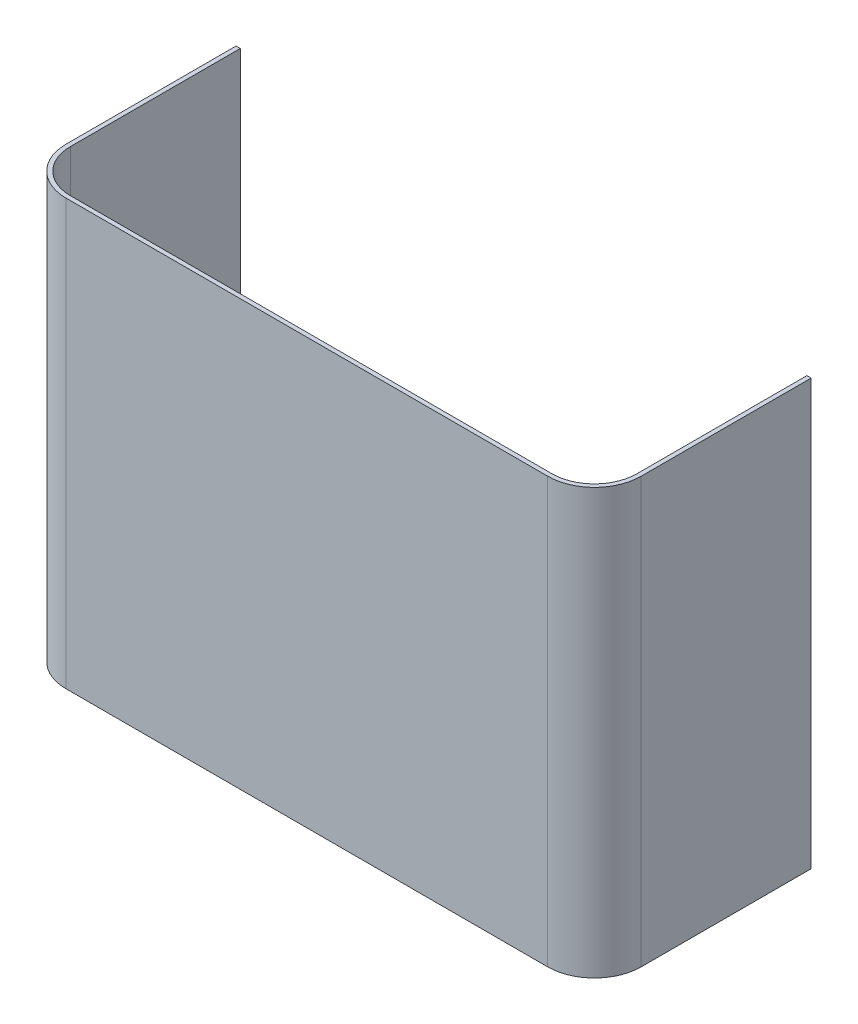
ISO-10303-21;
HEADER;
FILE_DESCRIPTION(('STEP AP214'),'2;1');
FILE_NAME('part.step','',(''),(''),'','','');
FILE_SCHEMA(('AUTOMOTIVE_DESIGN { 1 0 10303 214 1 1 1 1 }'));
ENDSEC;
DATA;
#1=APPLICATION_CONTEXT('core data for automotive mechanical design processes');
#2=APPLICATION_PROTOCOL_DEFINITION('international standard','automotive_design',2000,#1);
#3=PRODUCT_CONTEXT('',#1,'mechanical');
#4=PRODUCT('Part','Part','',(#3));
#5=PRODUCT_RELATED_PRODUCT_CATEGORY('part','',(#4));
#6=PRODUCT_DEFINITION_FORMATION('','',#4);
#7=PRODUCT_DEFINITION_CONTEXT('part definition',#1,'design');
#8=PRODUCT_DEFINITION('design','',#6,#7);
#9=PRODUCT_DEFINITION_SHAPE('','',#8);
#10=(LENGTH_UNIT() NAMED_UNIT(*) SI_UNIT(.MILLI.,.METRE.));
#11=(NAMED_UNIT(*) PLANE_ANGLE_UNIT() SI_UNIT($,.RADIAN.));
#12=(NAMED_UNIT(*) SI_UNIT($,.STERADIAN.) SOLID_ANGLE_UNIT());
#13=UNCERTAINTY_MEASURE_WITH_UNIT(LENGTH_MEASURE(1.E-05),#10,'distance_accuracy_value','');
#14=(GEOMETRIC_REPRESENTATION_CONTEXT(3) GLOBAL_UNCERTAINTY_ASSIGNED_CONTEXT((#13)) GLOBAL_UNIT_ASSIGNED_CONTEXT((#10,
#11,#12)) REPRESENTATION_CONTEXT('',''));
#15=CARTESIAN_POINT('',(0.,0.,0.));
#16=DIRECTION('',(0.,0.,1.));
#17=DIRECTION('',(1.,0.,0.));
#18=AXIS2_PLACEMENT_3D('',#15,#16,#17);
#19=CARTESIAN_POINT('',(-170.,0.,45.));
#20=DIRECTION('',(0.,-1.,0.));
#21=DIRECTION('',(0.,0.,-1.));
#22=AXIS2_PLACEMENT_3D('',#19,#20,#21);
#23=PLANE('',#22);
#24=DIRECTION('',(0.,0.,1.));
#25=VECTOR('',#24,1.);
#26=CARTESIAN_POINT('',(-203.,0.,45.));
#27=LINE('',#26,#25);
#28=CARTESIAN_POINT('',(-203.,0.,-75.));
#29=VERTEX_POINT('',#28);
#30=CARTESIAN_POINT('',(-203.,0.,45.));
#31=VERTEX_POINT('',#30);
#32=EDGE_CURVE('E38',#29,#31,#27,.T.);
#33=ORIENTED_EDGE('',*,*,#32,.F.);
#34=DIRECTION('',(1.,0.,0.));
#35=VECTOR('',#34,1.);
#36=CARTESIAN_POINT('',(-170.,0.,-75.));
#37=LINE('',#36,#35);
#38=CARTESIAN_POINT('',(-200.,0.,-75.));
#39=VERTEX_POINT('',#38);
#40=EDGE_CURVE('E179',#29,#39,#37,.T.);
#41=ORIENTED_EDGE('',*,*,#40,.T.);
#42=DIRECTION('',(0.,0.,1.));
#43=VECTOR('',#42,1.);
#44=CARTESIAN_POINT('',(-200.,0.,45.));
#45=LINE('',#44,#43);
#46=CARTESIAN_POINT('',(-200.,0.,45.));
#47=VERTEX_POINT('',#46);
#48=EDGE_CURVE('E170',#39,#47,#45,.T.);
#49=ORIENTED_EDGE('',*,*,#48,.T.);
#50=CARTESIAN_POINT('',(-170.,0.,45.));
#51=DIRECTION('',(0.,1.,0.));
#52=DIRECTION('',(0.,0.,-1.));
#53=AXIS2_PLACEMENT_3D('',#50,#51,#52);
#54=CIRCLE('',#53,30.);
#55=CARTESIAN_POINT('',(-170.,0.,75.));
#56=VERTEX_POINT('',#55);
#57=EDGE_CURVE('E162',#47,#56,#54,.T.);
#58=ORIENTED_EDGE('',*,*,#57,.T.);
#59=DIRECTION('',(1.,0.,0.));
#60=VECTOR('',#59,1.);
#61=CARTESIAN_POINT('',(-170.,0.,75.));
#62=LINE('',#61,#60);
#63=CARTESIAN_POINT('',(170.,0.,75.));
#64=VERTEX_POINT('',#63);
#65=EDGE_CURVE('E155',#56,#64,#62,.T.);
#66=ORIENTED_EDGE('',*,*,#65,.T.);
#67=CARTESIAN_POINT('',(170.,0.,45.));
#68=DIRECTION('',(0.,1.,0.));
#69=DIRECTION('',(0.,0.,-1.));
#70=AXIS2_PLACEMENT_3D('',#67,#68,#69);
#71=CIRCLE('',#70,30.);
#72=CARTESIAN_POINT('',(200.,0.,45.));
#73=VERTEX_POINT('',#72);
#74=EDGE_CURVE('E150',#64,#73,#71,.T.);
#75=ORIENTED_EDGE('',*,*,#74,.T.);
#76=DIRECTION('',(0.,0.,-1.));
#77=VECTOR('',#76,1.);
#78=CARTESIAN_POINT('',(200.,0.,45.));
#79=LINE('',#78,#77);
#80=CARTESIAN_POINT('',(200.,0.,-75.));
#81=VERTEX_POINT('',#80);
#82=EDGE_CURVE('E147',#73,#81,#79,.T.);
#83=ORIENTED_EDGE('',*,*,#82,.T.);
#84=CARTESIAN_POINT('',(203.,0.,-75.));
#85=VERTEX_POINT('',#84);
#86=EDGE_CURVE('E190',#81,#85,#37,.T.);
#87=ORIENTED_EDGE('',*,*,#86,.T.);
#88=DIRECTION('',(0.,0.,-1.));
#89=VECTOR('',#88,1.);
#90=CARTESIAN_POINT('',(203.,0.,45.));
#91=LINE('',#90,#89);
#92=CARTESIAN_POINT('',(203.,0.,45.));
#93=VERTEX_POINT('',#92);
#94=EDGE_CURVE('E129',#93,#85,#91,.T.);
#95=ORIENTED_EDGE('',*,*,#94,.F.);
#96=CARTESIAN_POINT('',(170.,0.,45.));
#97=DIRECTION('',(0.,-1.,0.));
#98=DIRECTION('',(0.,0.,-1.));
#99=AXIS2_PLACEMENT_3D('',#96,#97,#98);
#100=CIRCLE('',#99,33.);
#101=CARTESIAN_POINT('',(170.,0.,78.));
#102=VERTEX_POINT('',#101);
#103=EDGE_CURVE('E134',#102,#93,#100,.F.);
#104=ORIENTED_EDGE('',*,*,#103,.F.);
#105=DIRECTION('',(1.,0.,0.));
#106=VECTOR('',#105,1.);
#107=CARTESIAN_POINT('',(-170.,0.,78.));
#108=LINE('',#107,#106);
#109=CARTESIAN_POINT('',(-170.,0.,78.));
#110=VERTEX_POINT('',#109);
#111=EDGE_CURVE('E137',#110,#102,#108,.T.);
#112=ORIENTED_EDGE('',*,*,#111,.F.);
#113=CARTESIAN_POINT('',(-170.,0.,45.));
#114=DIRECTION('',(0.,-1.,0.));
#115=DIRECTION('',(0.,0.,-1.));
#116=AXIS2_PLACEMENT_3D('',#113,#114,#115);
#117=CIRCLE('',#116,33.);
#118=EDGE_CURVE('E121',#31,#110,#117,.F.);
#119=ORIENTED_EDGE('',*,*,#118,.F.);
#120=EDGE_LOOP('',(#33,#41,#49,#58,#66,#75,#83,#87,#95,#104,#112,#119));
#121=FACE_BOUND('',#120,.T.);
#122=ADVANCED_FACE('F34',(#121),#23,.T.);
#123=CARTESIAN_POINT('',(-170.,300.,44.999999999999));
#124=DIRECTION('',(0.,-1.,0.));
#125=DIRECTION('',(0.,0.,-1.));
#126=AXIS2_PLACEMENT_3D('',#123,#124,#125);
#127=PLANE('',#126);
#128=DIRECTION('',(1.,0.,0.));
#129=VECTOR('',#128,1.);
#130=CARTESIAN_POINT('',(-170.,300.,-75.000000000001));
#131=LINE('',#130,#129);
#132=CARTESIAN_POINT('',(-203.,300.,-75.000000000001));
#133=VERTEX_POINT('',#132);
#134=CARTESIAN_POINT('',(-200.,300.,-75.000000000001));
#135=VERTEX_POINT('',#134);
#136=EDGE_CURVE('E186',#133,#135,#131,.T.);
#137=ORIENTED_EDGE('',*,*,#136,.F.);
#138=DIRECTION('',(0.,0.,1.));
#139=VECTOR('',#138,1.);
#140=CARTESIAN_POINT('',(-203.,300.,45.));
#141=LINE('',#140,#139);
#142=CARTESIAN_POINT('',(-203.,300.,44.999999999999));
#143=VERTEX_POINT('',#142);
#144=EDGE_CURVE('E104',#133,#143,#141,.T.);
#145=ORIENTED_EDGE('',*,*,#144,.T.);
#146=CARTESIAN_POINT('',(-170.,300.,44.999999999999));
#147=DIRECTION('',(0.,-1.,0.));
#148=DIRECTION('',(0.,0.,-1.));
#149=AXIS2_PLACEMENT_3D('',#146,#147,#148);
#150=CIRCLE('',#149,33.);
#151=CARTESIAN_POINT('',(-170.,300.,77.999999999999));
#152=VERTEX_POINT('',#151);
#153=EDGE_CURVE('E98',#143,#152,#150,.F.);
#154=ORIENTED_EDGE('',*,*,#153,.T.);
#155=DIRECTION('',(1.,0.,0.));
#156=VECTOR('',#155,1.);
#157=CARTESIAN_POINT('',(-170.,300.,77.999999999999));
#158=LINE('',#157,#156);
#159=CARTESIAN_POINT('',(170.,300.,77.999999999999));
#160=VERTEX_POINT('',#159);
#161=EDGE_CURVE('E102',#152,#160,#158,.T.);
#162=ORIENTED_EDGE('',*,*,#161,.T.);
#163=CARTESIAN_POINT('',(170.,300.,44.999999999999));
#164=DIRECTION('',(0.,-1.,0.));
#165=DIRECTION('',(0.,0.,-1.));
#166=AXIS2_PLACEMENT_3D('',#163,#164,#165);
#167=CIRCLE('',#166,33.);
#168=CARTESIAN_POINT('',(203.,300.,44.999999999999));
#169=VERTEX_POINT('',#168);
#170=EDGE_CURVE('E59',#160,#169,#167,.F.);
#171=ORIENTED_EDGE('',*,*,#170,.T.);
#172=DIRECTION('',(0.,0.,-1.));
#173=VECTOR('',#172,1.);
#174=CARTESIAN_POINT('',(203.,300.,45.));
#175=LINE('',#174,#173);
#176=CARTESIAN_POINT('',(203.,300.,-75.000000000001));
#177=VERTEX_POINT('',#176);
#178=EDGE_CURVE('E11',#169,#177,#175,.T.);
#179=ORIENTED_EDGE('',*,*,#178,.T.);
#180=CARTESIAN_POINT('',(200.,300.,-75.000000000001));
#181=VERTEX_POINT('',#180);
#182=EDGE_CURVE('E193',#181,#177,#131,.T.);
#183=ORIENTED_EDGE('',*,*,#182,.F.);
#184=DIRECTION('',(0.,0.,-1.));
#185=VECTOR('',#184,1.);
#186=CARTESIAN_POINT('',(200.,300.,44.999999999999));
#187=LINE('',#186,#185);
#188=CARTESIAN_POINT('',(200.,300.,44.999999999999));
#189=VERTEX_POINT('',#188);
#190=EDGE_CURVE('E138',#189,#181,#187,.T.);
#191=ORIENTED_EDGE('',*,*,#190,.F.);
#192=CARTESIAN_POINT('',(170.,300.,44.999999999999));
#193=DIRECTION('',(0.,1.,0.));
#194=DIRECTION('',(0.,0.,-1.));
#195=AXIS2_PLACEMENT_3D('',#192,#193,#194);
#196=CIRCLE('',#195,30.);
#197=CARTESIAN_POINT('',(170.,300.,74.999999999999));
#198=VERTEX_POINT('',#197);
#199=EDGE_CURVE('E86',#198,#189,#196,.T.);
#200=ORIENTED_EDGE('',*,*,#199,.F.);
#201=DIRECTION('',(1.,0.,0.));
#202=VECTOR('',#201,1.);
#203=CARTESIAN_POINT('',(-170.,300.,74.999999999999));
#204=LINE('',#203,#202);
#205=CARTESIAN_POINT('',(-170.,300.,74.999999999999));
#206=VERTEX_POINT('',#205);
#207=EDGE_CURVE('E157',#206,#198,#204,.T.);
#208=ORIENTED_EDGE('',*,*,#207,.F.);
#209=CARTESIAN_POINT('',(-170.,300.,44.999999999999));
#210=DIRECTION('',(0.,1.,0.));
#211=DIRECTION('',(0.,0.,-1.));
#212=AXIS2_PLACEMENT_3D('',#209,#210,#211);
#213=CIRCLE('',#212,30.);
#214=CARTESIAN_POINT('',(-200.,300.,44.999999999999));
#215=VERTEX_POINT('',#214);
#216=EDGE_CURVE('E165',#215,#206,#213,.T.);
#217=ORIENTED_EDGE('',*,*,#216,.F.);
#218=DIRECTION('',(0.,0.,1.));
#219=VECTOR('',#218,1.);
#220=CARTESIAN_POINT('',(-200.,300.,44.999999999999));
#221=LINE('',#220,#219);
#222=EDGE_CURVE('E173',#135,#215,#221,.T.);
#223=ORIENTED_EDGE('',*,*,#222,.F.);
#224=EDGE_LOOP('',(#137,#145,#154,#162,#171,#179,#183,#191,#200,#208,#217,#223));
#225=FACE_BOUND('',#224,.T.);
#226=ADVANCED_FACE('F101',(#225),#127,.F.);
#227=CARTESIAN_POINT('',(-203.,0.,45.));
#228=DIRECTION('',(-1.,0.,0.));
#229=DIRECTION('',(0.,0.,1.));
#230=AXIS2_PLACEMENT_3D('',#227,#228,#229);
#231=PLANE('',#230);
#232=ORIENTED_EDGE('',*,*,#144,.F.);
#233=DIRECTION('',(0.,-1.,0.));
#234=VECTOR('',#233,1.);
#235=CARTESIAN_POINT('',(-203.,-4.04834597446372E-13,-75.));
#236=LINE('',#235,#234);
#237=EDGE_CURVE('E184',#133,#29,#236,.T.);
#238=ORIENTED_EDGE('',*,*,#237,.T.);
#239=ORIENTED_EDGE('',*,*,#32,.T.);
#240=DIRECTION('',(0.,1.,0.));
#241=VECTOR('',#240,1.);
#242=CARTESIAN_POINT('',(-203.,0.,45.));
#243=LINE('',#242,#241);
#244=EDGE_CURVE('E109',#31,#143,#243,.T.);
#245=ORIENTED_EDGE('',*,*,#244,.T.);
#246=EDGE_LOOP('',(#232,#238,#239,#245));
#247=FACE_BOUND('',#246,.T.);
#248=ADVANCED_FACE('F262',(#247),#231,.T.);
#249=CARTESIAN_POINT('',(203.,0.,45.));
#250=DIRECTION('',(1.,0.,0.));
#251=DIRECTION('',(0.,0.,-1.));
#252=AXIS2_PLACEMENT_3D('',#249,#250,#251);
#253=PLANE('',#252);
#254=ORIENTED_EDGE('',*,*,#94,.T.);
#255=DIRECTION('',(0.,1.,0.));
#256=VECTOR('',#255,1.);
#257=CARTESIAN_POINT('',(203.,-4.04834597446372E-13,-75.));
#258=LINE('',#257,#256);
#259=EDGE_CURVE('E187',#85,#177,#258,.T.);
#260=ORIENTED_EDGE('',*,*,#259,.T.);
#261=ORIENTED_EDGE('',*,*,#178,.F.);
#262=DIRECTION('',(0.,1.,0.));
#263=VECTOR('',#262,1.);
#264=CARTESIAN_POINT('',(203.,0.,45.));
#265=LINE('',#264,#263);
#266=EDGE_CURVE('E43',#93,#169,#265,.T.);
#267=ORIENTED_EDGE('',*,*,#266,.F.);
#268=EDGE_LOOP('',(#254,#260,#261,#267));
#269=FACE_BOUND('',#268,.T.);
#270=ADVANCED_FACE('F36',(#269),#253,.T.);
#271=CARTESIAN_POINT('',(-170.,0.,45.));
#272=DIRECTION('',(0.,1.,0.));
#273=DIRECTION('',(0.,0.,1.));
#274=AXIS2_PLACEMENT_3D('',#271,#272,#273);
#275=CYLINDRICAL_SURFACE('',#274,33.);
#276=DIRECTION('',(0.,1.,0.));
#277=VECTOR('',#276,1.);
#278=CARTESIAN_POINT('',(-170.,1.11177549744637E-13,78.));
#279=LINE('',#278,#277);
#280=EDGE_CURVE('E108',#110,#152,#279,.T.);
#281=ORIENTED_EDGE('',*,*,#280,.T.);
#282=ORIENTED_EDGE('',*,*,#153,.F.);
#283=ORIENTED_EDGE('',*,*,#244,.F.);
#284=ORIENTED_EDGE('',*,*,#118,.T.);
#285=EDGE_LOOP('',(#281,#282,#283,#284));
#286=FACE_BOUND('',#285,.T.);
#287=ADVANCED_FACE('F120',(#286),#275,.T.);
#288=CARTESIAN_POINT('',(-170.,0.,78.));
#289=DIRECTION('',(0.,0.,1.));
#290=DIRECTION('',(0.,-1.,0.));
#291=AXIS2_PLACEMENT_3D('',#288,#289,#290);
#292=PLANE('',#291);
#293=DIRECTION('',(0.,-1.,0.));
#294=VECTOR('',#293,1.);
#295=CARTESIAN_POINT('',(170.,0.,78.));
#296=LINE('',#295,#294);
#297=EDGE_CURVE('E117',#102,#160,#296,.F.);
#298=ORIENTED_EDGE('',*,*,#297,.T.);
#299=ORIENTED_EDGE('',*,*,#161,.F.);
#300=ORIENTED_EDGE('',*,*,#280,.F.);
#301=ORIENTED_EDGE('',*,*,#111,.T.);
#302=EDGE_LOOP('',(#298,#299,#300,#301));
#303=FACE_BOUND('',#302,.T.);
#304=ADVANCED_FACE('F114',(#303),#292,.T.);
#305=CARTESIAN_POINT('',(170.,0.,45.));
#306=DIRECTION('',(0.,1.,0.));
#307=DIRECTION('',(0.,0.,1.));
#308=AXIS2_PLACEMENT_3D('',#305,#306,#307);
#309=CYLINDRICAL_SURFACE('',#308,33.);
#310=ORIENTED_EDGE('',*,*,#266,.T.);
#311=ORIENTED_EDGE('',*,*,#170,.F.);
#312=ORIENTED_EDGE('',*,*,#297,.F.);
#313=ORIENTED_EDGE('',*,*,#103,.T.);
#314=EDGE_LOOP('',(#310,#311,#312,#313));
#315=FACE_BOUND('',#314,.T.);
#316=ADVANCED_FACE('F246',(#315),#309,.T.);
#317=CARTESIAN_POINT('',(-200.,0.,45.));
#318=DIRECTION('',(-1.,0.,0.));
#319=DIRECTION('',(0.,0.,1.));
#320=AXIS2_PLACEMENT_3D('',#317,#318,#319);
#321=PLANE('',#320);
#322=DIRECTION('',(0.,1.,0.));
#323=VECTOR('',#322,1.);
#324=CARTESIAN_POINT('',(-200.,0.,45.));
#325=LINE('',#324,#323);
#326=EDGE_CURVE('E167',#47,#215,#325,.T.);
#327=ORIENTED_EDGE('',*,*,#326,.F.);
#328=ORIENTED_EDGE('',*,*,#48,.F.);
#329=DIRECTION('',(0.,1.,0.));
#330=VECTOR('',#329,1.);
#331=CARTESIAN_POINT('',(-200.,0.,-75.));
#332=LINE('',#331,#330);
#333=EDGE_CURVE('E176',#39,#135,#332,.T.);
#334=ORIENTED_EDGE('',*,*,#333,.T.);
#335=ORIENTED_EDGE('',*,*,#222,.T.);
#336=EDGE_LOOP('',(#327,#328,#334,#335));
#337=FACE_BOUND('',#336,.T.);
#338=ADVANCED_FACE('F216',(#337),#321,.F.);
#339=CARTESIAN_POINT('',(-170.,0.,45.));
#340=DIRECTION('',(0.,1.,0.));
#341=DIRECTION('',(0.,0.,1.));
#342=AXIS2_PLACEMENT_3D('',#339,#340,#341);
#343=CYLINDRICAL_SURFACE('',#342,30.);
#344=DIRECTION('',(0.,1.,0.));
#345=VECTOR('',#344,1.);
#346=CARTESIAN_POINT('',(-170.,0.,75.));
#347=LINE('',#346,#345);
#348=EDGE_CURVE('E159',#56,#206,#347,.T.);
#349=ORIENTED_EDGE('',*,*,#348,.F.);
#350=ORIENTED_EDGE('',*,*,#57,.F.);
#351=ORIENTED_EDGE('',*,*,#326,.T.);
#352=ORIENTED_EDGE('',*,*,#216,.T.);
#353=EDGE_LOOP('',(#349,#350,#351,#352));
#354=FACE_BOUND('',#353,.T.);
#355=ADVANCED_FACE('F225',(#354),#343,.F.);
#356=CARTESIAN_POINT('',(-170.,0.,75.));
#357=DIRECTION('',(0.,0.,1.));
#358=DIRECTION('',(0.,-1.,0.));
#359=AXIS2_PLACEMENT_3D('',#356,#357,#358);
#360=PLANE('',#359);
#361=DIRECTION('',(0.,1.,0.));
#362=VECTOR('',#361,1.);
#363=CARTESIAN_POINT('',(170.,0.,75.));
#364=LINE('',#363,#362);
#365=EDGE_CURVE('E51',#64,#198,#364,.T.);
#366=ORIENTED_EDGE('',*,*,#365,.F.);
#367=ORIENTED_EDGE('',*,*,#65,.F.);
#368=ORIENTED_EDGE('',*,*,#348,.T.);
#369=ORIENTED_EDGE('',*,*,#207,.T.);
#370=EDGE_LOOP('',(#366,#367,#368,#369));
#371=FACE_BOUND('',#370,.T.);
#372=ADVANCED_FACE('F229',(#371),#360,.F.);
#373=CARTESIAN_POINT('',(170.,0.,45.));
#374=DIRECTION('',(0.,1.,0.));
#375=DIRECTION('',(0.,0.,1.));
#376=AXIS2_PLACEMENT_3D('',#373,#374,#375);
#377=CYLINDRICAL_SURFACE('',#376,30.);
#378=DIRECTION('',(0.,1.,0.));
#379=VECTOR('',#378,1.);
#380=CARTESIAN_POINT('',(200.,0.,45.));
#381=LINE('',#380,#379);
#382=EDGE_CURVE('E140',#73,#189,#381,.T.);
#383=ORIENTED_EDGE('',*,*,#382,.F.);
#384=ORIENTED_EDGE('',*,*,#74,.F.);
#385=ORIENTED_EDGE('',*,*,#365,.T.);
#386=ORIENTED_EDGE('',*,*,#199,.T.);
#387=EDGE_LOOP('',(#383,#384,#385,#386));
#388=FACE_BOUND('',#387,.T.);
#389=ADVANCED_FACE('F248',(#388),#377,.F.);
#390=CARTESIAN_POINT('',(200.,0.,45.));
#391=DIRECTION('',(1.,0.,0.));
#392=DIRECTION('',(0.,0.,-1.));
#393=AXIS2_PLACEMENT_3D('',#390,#391,#392);
#394=PLANE('',#393);
#395=ORIENTED_EDGE('',*,*,#190,.T.);
#396=DIRECTION('',(0.,1.,0.));
#397=VECTOR('',#396,1.);
#398=CARTESIAN_POINT('',(200.,0.,-75.));
#399=LINE('',#398,#397);
#400=EDGE_CURVE('E149',#81,#181,#399,.T.);
#401=ORIENTED_EDGE('',*,*,#400,.F.);
#402=ORIENTED_EDGE('',*,*,#82,.F.);
#403=ORIENTED_EDGE('',*,*,#382,.T.);
#404=EDGE_LOOP('',(#395,#401,#402,#403));
#405=FACE_BOUND('',#404,.T.);
#406=ADVANCED_FACE('F247',(#405),#394,.F.);
#407=CARTESIAN_POINT('',(0.,-2.53035438363357E-13,-75.));
#408=DIRECTION('',(0.,0.,-1.));
#409=DIRECTION('',(0.,1.,0.));
#410=AXIS2_PLACEMENT_3D('',#407,#408,#409);
#411=PLANE('',#410);
#412=ORIENTED_EDGE('',*,*,#86,.F.);
#413=ORIENTED_EDGE('',*,*,#400,.T.);
#414=ORIENTED_EDGE('',*,*,#182,.T.);
#415=ORIENTED_EDGE('',*,*,#259,.F.);
#416=EDGE_LOOP('',(#412,#413,#414,#415));
#417=FACE_BOUND('',#416,.T.);
#418=ADVANCED_FACE('F242',(#417),#411,.T.);
#419=ORIENTED_EDGE('',*,*,#237,.F.);
#420=ORIENTED_EDGE('',*,*,#136,.T.);
#421=ORIENTED_EDGE('',*,*,#333,.F.);
#422=ORIENTED_EDGE('',*,*,#40,.F.);
#423=EDGE_LOOP('',(#419,#420,#421,#422));
#424=FACE_BOUND('',#423,.T.);
#425=ADVANCED_FACE('F344',(#424),#411,.T.);
#426=CLOSED_SHELL('',(#122,#226,#248,#270,#287,#304,#316,#338,#355,#372,#389,#406,#418,#425));
#427=MANIFOLD_SOLID_BREP('B2',#426);
#428=ADVANCED_BREP_SHAPE_REPRESENTATION('',(#18,#427),#14);
#429=SHAPE_DEFINITION_REPRESENTATION(#9,#428);
ENDSEC;
END-ISO-10303-21;
